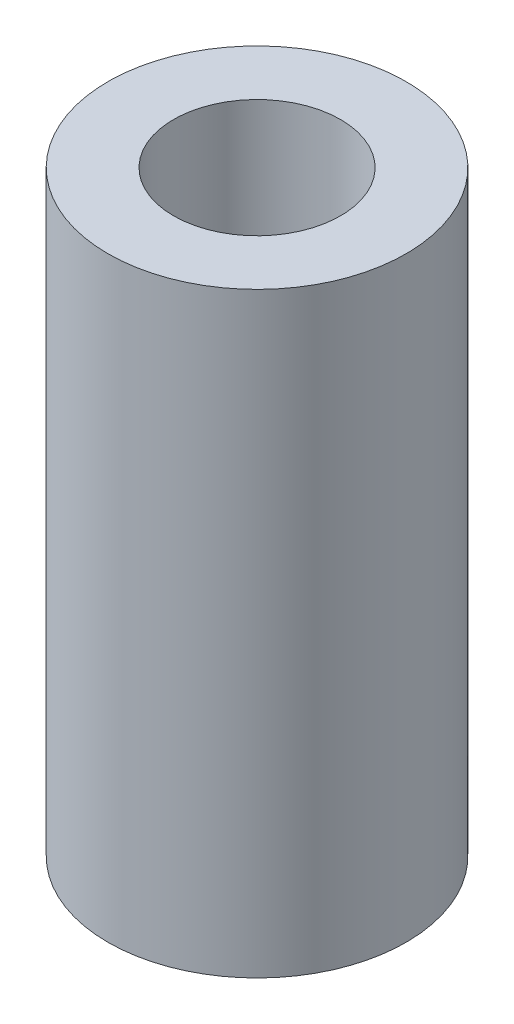
ISO-10303-21;
HEADER;
FILE_DESCRIPTION(('STEP AP214'),'2;1');
FILE_NAME('part.step','',(''),(''),'','','');
FILE_SCHEMA(('AUTOMOTIVE_DESIGN { 1 0 10303 214 1 1 1 1 }'));
ENDSEC;
DATA;
#1=APPLICATION_CONTEXT('core data for automotive mechanical design processes');
#2=APPLICATION_PROTOCOL_DEFINITION('international standard','automotive_design',2000,#1);
#3=PRODUCT_CONTEXT('',#1,'mechanical');
#4=PRODUCT('Part','Part','',(#3));
#5=PRODUCT_RELATED_PRODUCT_CATEGORY('part','',(#4));
#6=PRODUCT_DEFINITION_FORMATION('','',#4);
#7=PRODUCT_DEFINITION_CONTEXT('part definition',#1,'design');
#8=PRODUCT_DEFINITION('design','',#6,#7);
#9=PRODUCT_DEFINITION_SHAPE('','',#8);
#10=(LENGTH_UNIT() NAMED_UNIT(*) SI_UNIT(.MILLI.,.METRE.));
#11=(NAMED_UNIT(*) PLANE_ANGLE_UNIT() SI_UNIT($,.RADIAN.));
#12=(NAMED_UNIT(*) SI_UNIT($,.STERADIAN.) SOLID_ANGLE_UNIT());
#13=UNCERTAINTY_MEASURE_WITH_UNIT(LENGTH_MEASURE(1.E-05),#10,'distance_accuracy_value','');
#14=(GEOMETRIC_REPRESENTATION_CONTEXT(3) GLOBAL_UNCERTAINTY_ASSIGNED_CONTEXT((#13)) GLOBAL_UNIT_ASSIGNED_CONTEXT((#10,
#11,#12)) REPRESENTATION_CONTEXT('',''));
#15=CARTESIAN_POINT('',(0.,0.,0.));
#16=DIRECTION('',(0.,0.,1.));
#17=DIRECTION('',(1.,0.,0.));
#18=AXIS2_PLACEMENT_3D('',#15,#16,#17);
#19=CARTESIAN_POINT('',(0.,10.,0.));
#20=DIRECTION('',(0.,1.,0.));
#21=DIRECTION('',(0.,0.,1.));
#22=AXIS2_PLACEMENT_3D('',#19,#20,#21);
#23=PLANE('',#22);
#24=CARTESIAN_POINT('',(0.,10.,0.));
#25=DIRECTION('',(0.,1.,0.));
#26=DIRECTION('',(0.,0.,1.));
#27=AXIS2_PLACEMENT_3D('',#24,#25,#26);
#28=CIRCLE('',#27,2.5);
#29=CARTESIAN_POINT('',(0.,10.,2.5));
#30=VERTEX_POINT('',#29);
#31=EDGE_CURVE('E10',#30,#30,#28,.T.);
#32=ORIENTED_EDGE('',*,*,#31,.T.);
#33=EDGE_LOOP('',(#32));
#34=FACE_BOUND('',#33,.T.);
#35=CARTESIAN_POINT('',(0.,10.,0.));
#36=DIRECTION('',(0.,1.,0.));
#37=DIRECTION('',(0.,0.,1.));
#38=AXIS2_PLACEMENT_3D('',#35,#36,#37);
#39=CIRCLE('',#38,1.4);
#40=CARTESIAN_POINT('',(0.,10.,1.4));
#41=VERTEX_POINT('',#40);
#42=EDGE_CURVE('E42',#41,#41,#39,.T.);
#43=ORIENTED_EDGE('',*,*,#42,.F.);
#44=EDGE_LOOP('',(#43));
#45=FACE_BOUND('',#44,.T.);
#46=ADVANCED_FACE('F31',(#34,#45),#23,.T.);
#47=CARTESIAN_POINT('',(0.,0.,0.));
#48=DIRECTION('',(0.,1.,0.));
#49=DIRECTION('',(0.,0.,1.));
#50=AXIS2_PLACEMENT_3D('',#47,#48,#49);
#51=PLANE('',#50);
#52=CARTESIAN_POINT('',(0.,0.,0.));
#53=DIRECTION('',(0.,1.,0.));
#54=DIRECTION('',(0.,0.,1.));
#55=AXIS2_PLACEMENT_3D('',#52,#53,#54);
#56=CIRCLE('',#55,2.5);
#57=CARTESIAN_POINT('',(0.,0.,2.5));
#58=VERTEX_POINT('',#57);
#59=EDGE_CURVE('E35',#58,#58,#56,.T.);
#60=ORIENTED_EDGE('',*,*,#59,.F.);
#61=EDGE_LOOP('',(#60));
#62=FACE_BOUND('',#61,.T.);
#63=CARTESIAN_POINT('',(0.,0.,0.));
#64=DIRECTION('',(0.,1.,0.));
#65=DIRECTION('',(0.,0.,1.));
#66=AXIS2_PLACEMENT_3D('',#63,#64,#65);
#67=CIRCLE('',#66,1.4);
#68=CARTESIAN_POINT('',(0.,0.,1.4));
#69=VERTEX_POINT('',#68);
#70=EDGE_CURVE('E44',#69,#69,#67,.T.);
#71=ORIENTED_EDGE('',*,*,#70,.T.);
#72=EDGE_LOOP('',(#71));
#73=FACE_BOUND('',#72,.T.);
#74=ADVANCED_FACE('F54',(#62,#73),#51,.F.);
#75=CARTESIAN_POINT('',(0.,10.,0.));
#76=DIRECTION('',(0.,-1.,0.));
#77=DIRECTION('',(0.,0.,-1.));
#78=AXIS2_PLACEMENT_3D('',#75,#76,#77);
#79=CYLINDRICAL_SURFACE('',#78,2.5);
#80=ORIENTED_EDGE('',*,*,#31,.F.);
#81=EDGE_LOOP('',(#80));
#82=FACE_BOUND('',#81,.T.);
#83=ORIENTED_EDGE('',*,*,#59,.T.);
#84=EDGE_LOOP('',(#83));
#85=FACE_BOUND('',#84,.T.);
#86=ADVANCED_FACE('F33',(#82,#85),#79,.T.);
#87=CARTESIAN_POINT('',(0.,10.,0.));
#88=DIRECTION('',(0.,-1.,0.));
#89=DIRECTION('',(0.,0.,-1.));
#90=AXIS2_PLACEMENT_3D('',#87,#88,#89);
#91=CYLINDRICAL_SURFACE('',#90,1.4);
#92=ORIENTED_EDGE('',*,*,#42,.T.);
#93=EDGE_LOOP('',(#92));
#94=FACE_BOUND('',#93,.T.);
#95=ORIENTED_EDGE('',*,*,#70,.F.);
#96=EDGE_LOOP('',(#95));
#97=FACE_BOUND('',#96,.T.);
#98=ADVANCED_FACE('F50',(#94,#97),#91,.F.);
#99=CLOSED_SHELL('',(#46,#74,#86,#98));
#100=MANIFOLD_SOLID_BREP('B2',#99);
#101=ADVANCED_BREP_SHAPE_REPRESENTATION('',(#18,#100),#14);
#102=SHAPE_DEFINITION_REPRESENTATION(#9,#101);
ENDSEC;
END-ISO-10303-21;
